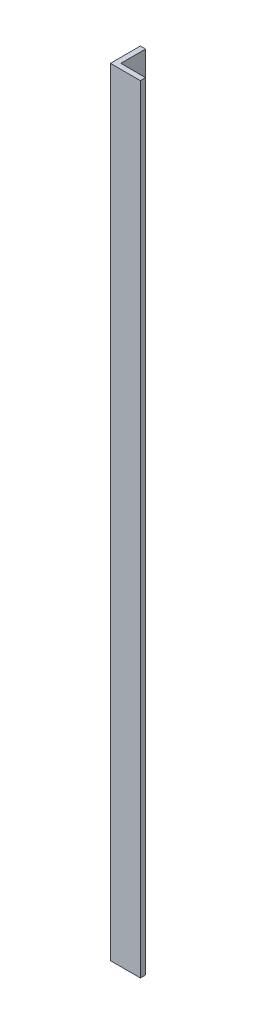
ISO-10303-21;
HEADER;
FILE_DESCRIPTION(('STEP AP214'),'2;1');
FILE_NAME('part.step','',(''),(''),'','','');
FILE_SCHEMA(('AUTOMOTIVE_DESIGN { 1 0 10303 214 1 1 1 1 }'));
ENDSEC;
DATA;
#1=APPLICATION_CONTEXT('core data for automotive mechanical design processes');
#2=APPLICATION_PROTOCOL_DEFINITION('international standard','automotive_design',2000,#1);
#3=PRODUCT_CONTEXT('',#1,'mechanical');
#4=PRODUCT('Part','Part','',(#3));
#5=PRODUCT_RELATED_PRODUCT_CATEGORY('part','',(#4));
#6=PRODUCT_DEFINITION_FORMATION('','',#4);
#7=PRODUCT_DEFINITION_CONTEXT('part definition',#1,'design');
#8=PRODUCT_DEFINITION('design','',#6,#7);
#9=PRODUCT_DEFINITION_SHAPE('','',#8);
#10=(LENGTH_UNIT() NAMED_UNIT(*) SI_UNIT(.MILLI.,.METRE.));
#11=(NAMED_UNIT(*) PLANE_ANGLE_UNIT() SI_UNIT($,.RADIAN.));
#12=(NAMED_UNIT(*) SI_UNIT($,.STERADIAN.) SOLID_ANGLE_UNIT());
#13=UNCERTAINTY_MEASURE_WITH_UNIT(LENGTH_MEASURE(1.E-05),#10,'distance_accuracy_value','');
#14=(GEOMETRIC_REPRESENTATION_CONTEXT(3) GLOBAL_UNCERTAINTY_ASSIGNED_CONTEXT((#13)) GLOBAL_UNIT_ASSIGNED_CONTEXT((#10,
#11,#12)) REPRESENTATION_CONTEXT('',''));
#15=CARTESIAN_POINT('',(0.,0.,0.));
#16=DIRECTION('',(0.,0.,1.));
#17=DIRECTION('',(1.,0.,0.));
#18=AXIS2_PLACEMENT_3D('',#15,#16,#17);
#19=CARTESIAN_POINT('',(19.31,500.,0.));
#20=DIRECTION('',(0.,0.,-1.));
#21=DIRECTION('',(-1.,0.,0.));
#22=AXIS2_PLACEMENT_3D('',#19,#20,#21);
#23=PLANE('',#22);
#24=DIRECTION('',(1.,0.,0.));
#25=VECTOR('',#24,1.);
#26=CARTESIAN_POINT('',(19.31,0.,0.));
#27=LINE('',#26,#25);
#28=CARTESIAN_POINT('',(0.,0.,0.));
#29=VERTEX_POINT('',#28);
#30=CARTESIAN_POINT('',(19.31,0.,0.));
#31=VERTEX_POINT('',#30);
#32=EDGE_CURVE('E116',#29,#31,#27,.T.);
#33=ORIENTED_EDGE('',*,*,#32,.T.);
#34=DIRECTION('',(0.,-1.,0.));
#35=VECTOR('',#34,1.);
#36=CARTESIAN_POINT('',(19.31,500.,0.));
#37=LINE('',#36,#35);
#38=CARTESIAN_POINT('',(19.31,500.,0.));
#39=VERTEX_POINT('',#38);
#40=EDGE_CURVE('E11',#39,#31,#37,.T.);
#41=ORIENTED_EDGE('',*,*,#40,.F.);
#42=DIRECTION('',(1.,0.,0.));
#43=VECTOR('',#42,1.);
#44=CARTESIAN_POINT('',(19.31,500.,0.));
#45=LINE('',#44,#43);
#46=CARTESIAN_POINT('',(0.,500.,0.));
#47=VERTEX_POINT('',#46);
#48=EDGE_CURVE('E126',#47,#39,#45,.T.);
#49=ORIENTED_EDGE('',*,*,#48,.F.);
#50=DIRECTION('',(0.,-1.,0.));
#51=VECTOR('',#50,1.);
#52=CARTESIAN_POINT('',(0.,500.,0.));
#53=LINE('',#52,#51);
#54=EDGE_CURVE('E112',#47,#29,#53,.T.);
#55=ORIENTED_EDGE('',*,*,#54,.T.);
#56=EDGE_LOOP('',(#33,#41,#49,#55));
#57=FACE_BOUND('',#56,.T.);
#58=ADVANCED_FACE('F32',(#57),#23,.F.);
#59=CARTESIAN_POINT('',(19.31,500.,-3.35));
#60=DIRECTION('',(-1.,0.,0.));
#61=DIRECTION('',(0.,0.,1.));
#62=AXIS2_PLACEMENT_3D('',#59,#60,#61);
#63=PLANE('',#62);
#64=DIRECTION('',(0.,0.,-1.));
#65=VECTOR('',#64,1.);
#66=CARTESIAN_POINT('',(19.31,0.,-3.35));
#67=LINE('',#66,#65);
#68=CARTESIAN_POINT('',(19.31,0.,-3.35));
#69=VERTEX_POINT('',#68);
#70=EDGE_CURVE('E119',#31,#69,#67,.T.);
#71=ORIENTED_EDGE('',*,*,#70,.T.);
#72=DIRECTION('',(0.,-1.,0.));
#73=VECTOR('',#72,1.);
#74=CARTESIAN_POINT('',(19.31,500.,-3.35));
#75=LINE('',#74,#73);
#76=CARTESIAN_POINT('',(19.31,500.,-3.35));
#77=VERTEX_POINT('',#76);
#78=EDGE_CURVE('E40',#77,#69,#75,.T.);
#79=ORIENTED_EDGE('',*,*,#78,.F.);
#80=DIRECTION('',(0.,0.,-1.));
#81=VECTOR('',#80,1.);
#82=CARTESIAN_POINT('',(19.31,500.,-3.35));
#83=LINE('',#82,#81);
#84=EDGE_CURVE('E85',#39,#77,#83,.T.);
#85=ORIENTED_EDGE('',*,*,#84,.F.);
#86=ORIENTED_EDGE('',*,*,#40,.T.);
#87=EDGE_LOOP('',(#71,#79,#85,#86));
#88=FACE_BOUND('',#87,.T.);
#89=ADVANCED_FACE('F150',(#88),#63,.F.);
#90=CARTESIAN_POINT('',(3.35,500.,-3.35));
#91=DIRECTION('',(0.,0.,1.));
#92=DIRECTION('',(1.,0.,0.));
#93=AXIS2_PLACEMENT_3D('',#90,#91,#92);
#94=PLANE('',#93);
#95=DIRECTION('',(-1.,0.,0.));
#96=VECTOR('',#95,1.);
#97=CARTESIAN_POINT('',(3.35,0.,-3.35));
#98=LINE('',#97,#96);
#99=CARTESIAN_POINT('',(3.35,0.,-3.35));
#100=VERTEX_POINT('',#99);
#101=EDGE_CURVE('E121',#69,#100,#98,.T.);
#102=ORIENTED_EDGE('',*,*,#101,.T.);
#103=DIRECTION('',(0.,-1.,0.));
#104=VECTOR('',#103,1.);
#105=CARTESIAN_POINT('',(3.35,500.,-3.35));
#106=LINE('',#105,#104);
#107=CARTESIAN_POINT('',(3.35,500.,-3.35));
#108=VERTEX_POINT('',#107);
#109=EDGE_CURVE('E107',#108,#100,#106,.T.);
#110=ORIENTED_EDGE('',*,*,#109,.F.);
#111=DIRECTION('',(-1.,0.,0.));
#112=VECTOR('',#111,1.);
#113=CARTESIAN_POINT('',(3.35,500.,-3.35));
#114=LINE('',#113,#112);
#115=EDGE_CURVE('E98',#77,#108,#114,.T.);
#116=ORIENTED_EDGE('',*,*,#115,.F.);
#117=ORIENTED_EDGE('',*,*,#78,.T.);
#118=EDGE_LOOP('',(#102,#110,#116,#117));
#119=FACE_BOUND('',#118,.T.);
#120=ADVANCED_FACE('F132',(#119),#94,.F.);
#121=CARTESIAN_POINT('',(3.35,500.,-19.31));
#122=DIRECTION('',(-1.,0.,0.));
#123=DIRECTION('',(0.,0.,1.));
#124=AXIS2_PLACEMENT_3D('',#121,#122,#123);
#125=PLANE('',#124);
#126=DIRECTION('',(0.,0.,-1.));
#127=VECTOR('',#126,1.);
#128=CARTESIAN_POINT('',(3.35,0.,-19.31));
#129=LINE('',#128,#127);
#130=CARTESIAN_POINT('',(3.35,0.,-19.31));
#131=VERTEX_POINT('',#130);
#132=EDGE_CURVE('E106',#100,#131,#129,.T.);
#133=ORIENTED_EDGE('',*,*,#132,.T.);
#134=DIRECTION('',(0.,-1.,0.));
#135=VECTOR('',#134,1.);
#136=CARTESIAN_POINT('',(3.35,500.,-19.31));
#137=LINE('',#136,#135);
#138=CARTESIAN_POINT('',(3.35,500.,-19.31));
#139=VERTEX_POINT('',#138);
#140=EDGE_CURVE('E103',#139,#131,#137,.T.);
#141=ORIENTED_EDGE('',*,*,#140,.F.);
#142=DIRECTION('',(0.,0.,-1.));
#143=VECTOR('',#142,1.);
#144=CARTESIAN_POINT('',(3.35,500.,-19.31));
#145=LINE('',#144,#143);
#146=EDGE_CURVE('E92',#108,#139,#145,.T.);
#147=ORIENTED_EDGE('',*,*,#146,.F.);
#148=ORIENTED_EDGE('',*,*,#109,.T.);
#149=EDGE_LOOP('',(#133,#141,#147,#148));
#150=FACE_BOUND('',#149,.T.);
#151=ADVANCED_FACE('F104',(#150),#125,.F.);
#152=CARTESIAN_POINT('',(0.,500.,-19.31));
#153=DIRECTION('',(0.,0.,1.));
#154=DIRECTION('',(1.,0.,0.));
#155=AXIS2_PLACEMENT_3D('',#152,#153,#154);
#156=PLANE('',#155);
#157=DIRECTION('',(-1.,0.,0.));
#158=VECTOR('',#157,1.);
#159=CARTESIAN_POINT('',(0.,0.,-19.31));
#160=LINE('',#159,#158);
#161=CARTESIAN_POINT('',(0.,0.,-19.31));
#162=VERTEX_POINT('',#161);
#163=EDGE_CURVE('E71',#131,#162,#160,.T.);
#164=ORIENTED_EDGE('',*,*,#163,.T.);
#165=DIRECTION('',(0.,-1.,0.));
#166=VECTOR('',#165,1.);
#167=CARTESIAN_POINT('',(0.,500.,-19.31));
#168=LINE('',#167,#166);
#169=CARTESIAN_POINT('',(0.,500.,-19.31));
#170=VERTEX_POINT('',#169);
#171=EDGE_CURVE('E108',#170,#162,#168,.T.);
#172=ORIENTED_EDGE('',*,*,#171,.F.);
#173=DIRECTION('',(-1.,0.,0.));
#174=VECTOR('',#173,1.);
#175=CARTESIAN_POINT('',(0.,500.,-19.31));
#176=LINE('',#175,#174);
#177=EDGE_CURVE('E96',#139,#170,#176,.T.);
#178=ORIENTED_EDGE('',*,*,#177,.F.);
#179=ORIENTED_EDGE('',*,*,#140,.T.);
#180=EDGE_LOOP('',(#164,#172,#178,#179));
#181=FACE_BOUND('',#180,.T.);
#182=ADVANCED_FACE('F110',(#181),#156,.F.);
#183=CARTESIAN_POINT('',(0.,500.,0.));
#184=DIRECTION('',(1.,0.,0.));
#185=DIRECTION('',(0.,0.,-1.));
#186=AXIS2_PLACEMENT_3D('',#183,#184,#185);
#187=PLANE('',#186);
#188=DIRECTION('',(0.,0.,1.));
#189=VECTOR('',#188,1.);
#190=CARTESIAN_POINT('',(0.,0.,0.));
#191=LINE('',#190,#189);
#192=EDGE_CURVE('E77',#162,#29,#191,.T.);
#193=ORIENTED_EDGE('',*,*,#192,.T.);
#194=ORIENTED_EDGE('',*,*,#54,.F.);
#195=DIRECTION('',(0.,0.,1.));
#196=VECTOR('',#195,1.);
#197=CARTESIAN_POINT('',(0.,500.,0.));
#198=LINE('',#197,#196);
#199=EDGE_CURVE('E48',#170,#47,#198,.T.);
#200=ORIENTED_EDGE('',*,*,#199,.F.);
#201=ORIENTED_EDGE('',*,*,#171,.T.);
#202=EDGE_LOOP('',(#193,#194,#200,#201));
#203=FACE_BOUND('',#202,.T.);
#204=ADVANCED_FACE('F139',(#203),#187,.F.);
#205=CARTESIAN_POINT('',(0.,500.,0.));
#206=DIRECTION('',(0.,-1.,0.));
#207=DIRECTION('',(0.,0.,-1.));
#208=AXIS2_PLACEMENT_3D('',#205,#206,#207);
#209=PLANE('',#208);
#210=ORIENTED_EDGE('',*,*,#48,.T.);
#211=ORIENTED_EDGE('',*,*,#84,.T.);
#212=ORIENTED_EDGE('',*,*,#115,.T.);
#213=ORIENTED_EDGE('',*,*,#146,.T.);
#214=ORIENTED_EDGE('',*,*,#177,.T.);
#215=ORIENTED_EDGE('',*,*,#199,.T.);
#216=EDGE_LOOP('',(#210,#211,#212,#213,#214,#215));
#217=FACE_BOUND('',#216,.T.);
#218=ADVANCED_FACE('F94',(#217),#209,.F.);
#219=CARTESIAN_POINT('',(0.,0.,0.));
#220=DIRECTION('',(0.,-1.,0.));
#221=DIRECTION('',(0.,0.,-1.));
#222=AXIS2_PLACEMENT_3D('',#219,#220,#221);
#223=PLANE('',#222);
#224=ORIENTED_EDGE('',*,*,#32,.F.);
#225=ORIENTED_EDGE('',*,*,#192,.F.);
#226=ORIENTED_EDGE('',*,*,#163,.F.);
#227=ORIENTED_EDGE('',*,*,#132,.F.);
#228=ORIENTED_EDGE('',*,*,#101,.F.);
#229=ORIENTED_EDGE('',*,*,#70,.F.);
#230=EDGE_LOOP('',(#224,#225,#226,#227,#228,#229));
#231=FACE_BOUND('',#230,.T.);
#232=ADVANCED_FACE('F135',(#231),#223,.T.);
#233=CLOSED_SHELL('',(#58,#89,#120,#151,#182,#204,#218,#232));
#234=MANIFOLD_SOLID_BREP('B2',#233);
#235=ADVANCED_BREP_SHAPE_REPRESENTATION('',(#18,#234),#14);
#236=SHAPE_DEFINITION_REPRESENTATION(#9,#235);
ENDSEC;
END-ISO-10303-21;
